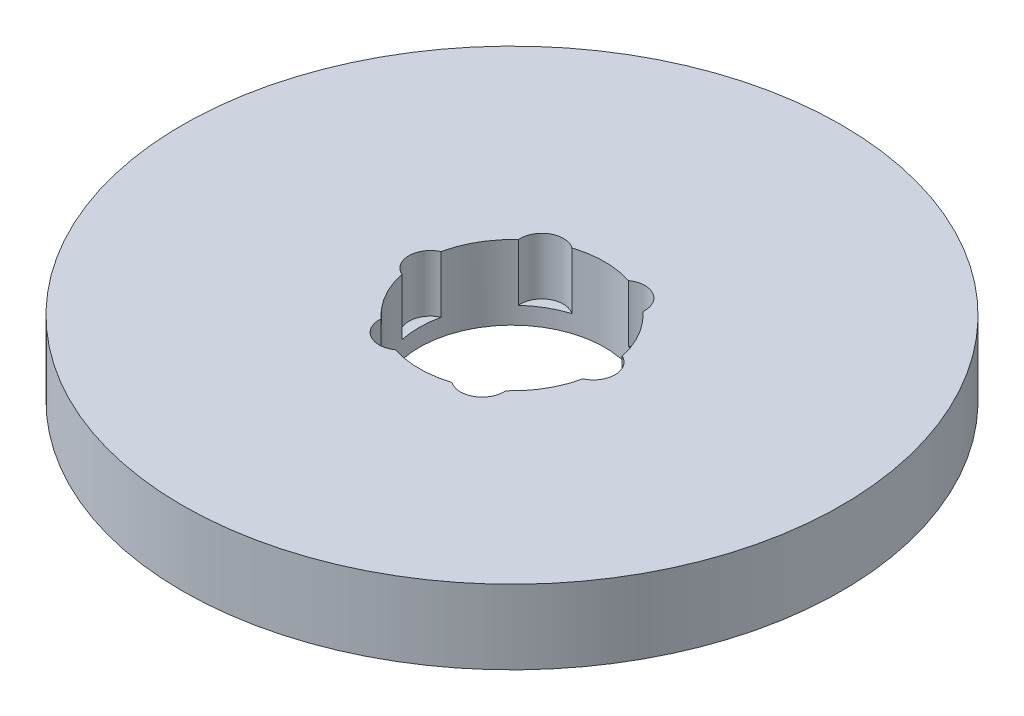
ISO-10303-21;
HEADER;
FILE_DESCRIPTION(('STEP AP214'),'2;1');
FILE_NAME('part.step','',(''),(''),'','','');
FILE_SCHEMA(('AUTOMOTIVE_DESIGN { 1 0 10303 214 1 1 1 1 }'));
ENDSEC;
DATA;
#1=APPLICATION_CONTEXT('core data for automotive mechanical design processes');
#2=APPLICATION_PROTOCOL_DEFINITION('international standard','automotive_design',2000,#1);
#3=PRODUCT_CONTEXT('',#1,'mechanical');
#4=PRODUCT('Part','Part','',(#3));
#5=PRODUCT_RELATED_PRODUCT_CATEGORY('part','',(#4));
#6=PRODUCT_DEFINITION_FORMATION('','',#4);
#7=PRODUCT_DEFINITION_CONTEXT('part definition',#1,'design');
#8=PRODUCT_DEFINITION('design','',#6,#7);
#9=PRODUCT_DEFINITION_SHAPE('','',#8);
#10=(LENGTH_UNIT() NAMED_UNIT(*) SI_UNIT(.MILLI.,.METRE.));
#11=(NAMED_UNIT(*) PLANE_ANGLE_UNIT() SI_UNIT($,.RADIAN.));
#12=(NAMED_UNIT(*) SI_UNIT($,.STERADIAN.) SOLID_ANGLE_UNIT());
#13=UNCERTAINTY_MEASURE_WITH_UNIT(LENGTH_MEASURE(1.E-05),#10,'distance_accuracy_value','');
#14=(GEOMETRIC_REPRESENTATION_CONTEXT(3) GLOBAL_UNCERTAINTY_ASSIGNED_CONTEXT((#13)) GLOBAL_UNIT_ASSIGNED_CONTEXT((#10,
#11,#12)) REPRESENTATION_CONTEXT('',''));
#15=CARTESIAN_POINT('',(0.,0.,0.));
#16=DIRECTION('',(0.,0.,1.));
#17=DIRECTION('',(1.,0.,0.));
#18=AXIS2_PLACEMENT_3D('',#15,#16,#17);
#19=CARTESIAN_POINT('',(0.,18.,0.));
#20=DIRECTION('',(0.,-1.,0.));
#21=DIRECTION('',(0.,0.,-1.));
#22=AXIS2_PLACEMENT_3D('',#19,#20,#21);
#23=CYLINDRICAL_SURFACE('',#22,80.);
#24=CARTESIAN_POINT('',(0.,18.,0.));
#25=DIRECTION('',(0.,1.,0.));
#26=DIRECTION('',(0.,0.,1.));
#27=AXIS2_PLACEMENT_3D('',#24,#25,#26);
#28=CIRCLE('',#27,80.);
#29=CARTESIAN_POINT('',(0.,18.,80.));
#30=VERTEX_POINT('',#29);
#31=EDGE_CURVE('E162',#30,#30,#28,.T.);
#32=ORIENTED_EDGE('',*,*,#31,.F.);
#33=EDGE_LOOP('',(#32));
#34=FACE_BOUND('',#33,.T.);
#35=CARTESIAN_POINT('',(0.,0.,0.));
#36=DIRECTION('',(0.,1.,0.));
#37=DIRECTION('',(0.,0.,1.));
#38=AXIS2_PLACEMENT_3D('',#35,#36,#37);
#39=CIRCLE('',#38,80.);
#40=CARTESIAN_POINT('',(0.,0.,80.));
#41=VERTEX_POINT('',#40);
#42=EDGE_CURVE('E157',#41,#41,#39,.T.);
#43=ORIENTED_EDGE('',*,*,#42,.T.);
#44=EDGE_LOOP('',(#43));
#45=FACE_BOUND('',#44,.T.);
#46=ADVANCED_FACE('F39',(#34,#45),#23,.T.);
#47=CARTESIAN_POINT('',(0.,18.,0.));
#48=DIRECTION('',(0.,1.,0.));
#49=DIRECTION('',(0.,0.,1.));
#50=AXIS2_PLACEMENT_3D('',#47,#48,#49);
#51=PLANE('',#50);
#52=CARTESIAN_POINT('',(-9.88576578177783,18.,-17.1226486057646));
#53=DIRECTION('',(0.,1.,0.));
#54=DIRECTION('',(-0.866025403784433,0.,0.50000000000001));
#55=AXIS2_PLACEMENT_3D('',#52,#53,#54);
#56=CIRCLE('',#55,5.25857324103569);
#57=CARTESIAN_POINT('',(-6.86511004216114,18.,-21.4270918257476));
#58=VERTEX_POINT('',#57);
#59=CARTESIAN_POINT('',(-15.1238508292391,18.,-16.6589056091606));
#60=VERTEX_POINT('',#59);
#61=EDGE_CURVE('E218',#58,#60,#56,.T.);
#62=ORIENTED_EDGE('',*,*,#61,.F.);
#63=CARTESIAN_POINT('',(0.,18.,0.));
#64=DIRECTION('',(0.,1.,0.));
#65=DIRECTION('',(0.,0.,1.));
#66=AXIS2_PLACEMENT_3D('',#63,#64,#65);
#67=CIRCLE('',#66,22.5);
#68=CARTESIAN_POINT('',(6.8651100421607,18.,-21.4270918257477));
#69=VERTEX_POINT('',#68);
#70=EDGE_CURVE('E169',#69,#58,#67,.T.);
#71=ORIENTED_EDGE('',*,*,#70,.F.);
#72=CARTESIAN_POINT('',(9.88576578177747,18.,-17.1226486057648));
#73=DIRECTION('',(0.,1.,0.));
#74=DIRECTION('',(-0.866025403784443,0.,-0.499999999999992));
#75=AXIS2_PLACEMENT_3D('',#72,#73,#74);
#76=CIRCLE('',#75,5.25857324103569);
#77=CARTESIAN_POINT('',(15.1238508292388,18.,-16.658905609161));
#78=VERTEX_POINT('',#77);
#79=EDGE_CURVE('E285',#78,#69,#76,.T.);
#80=ORIENTED_EDGE('',*,*,#79,.F.);
#81=CARTESIAN_POINT('',(21.9889608713998,18.,-4.76818621658683));
#82=VERTEX_POINT('',#81);
#83=EDGE_CURVE('E174',#82,#78,#67,.T.);
#84=ORIENTED_EDGE('',*,*,#83,.F.);
#85=CARTESIAN_POINT('',(19.7715315635553,18.,0.));
#86=DIRECTION('',(0.,1.,0.));
#87=DIRECTION('',(0.,0.,-1.));
#88=AXIS2_PLACEMENT_3D('',#85,#86,#87);
#89=CIRCLE('',#88,5.25857324103569);
#90=CARTESIAN_POINT('',(21.9889608713998,18.,4.76818621658683));
#91=VERTEX_POINT('',#90);
#92=EDGE_CURVE('E280',#91,#82,#89,.T.);
#93=ORIENTED_EDGE('',*,*,#92,.F.);
#94=CARTESIAN_POINT('',(15.123850829239,18.,16.6589056091607));
#95=VERTEX_POINT('',#94);
#96=EDGE_CURVE('E164',#95,#91,#67,.T.);
#97=ORIENTED_EDGE('',*,*,#96,.F.);
#98=CARTESIAN_POINT('',(9.88576578177771,18.,17.1226486057647));
#99=DIRECTION('',(0.,1.,0.));
#100=DIRECTION('',(0.866025403784436,0.,-0.500000000000004));
#101=AXIS2_PLACEMENT_3D('',#98,#99,#100);
#102=CIRCLE('',#101,5.25857324103569);
#103=CARTESIAN_POINT('',(6.86511004216099,18.,21.4270918257476));
#104=VERTEX_POINT('',#103);
#105=EDGE_CURVE('E269',#104,#95,#102,.T.);
#106=ORIENTED_EDGE('',*,*,#105,.F.);
#107=CARTESIAN_POINT('',(-6.86511004216084,18.,21.4270918257477));
#108=VERTEX_POINT('',#107);
#109=EDGE_CURVE('E149',#108,#104,#67,.T.);
#110=ORIENTED_EDGE('',*,*,#109,.F.);
#111=CARTESIAN_POINT('',(-9.88576578177759,18.,17.1226486057647));
#112=DIRECTION('',(0.,1.,0.));
#113=DIRECTION('',(0.86602540378444,0.,0.499999999999998));
#114=AXIS2_PLACEMENT_3D('',#111,#112,#113);
#115=CIRCLE('',#114,5.25857324103569);
#116=CARTESIAN_POINT('',(-15.1238508292389,18.,16.6589056091609));
#117=VERTEX_POINT('',#116);
#118=EDGE_CURVE('E128',#117,#108,#115,.T.);
#119=ORIENTED_EDGE('',*,*,#118,.F.);
#120=CARTESIAN_POINT('',(-21.9889608713998,18.,4.76818621658683));
#121=VERTEX_POINT('',#120);
#122=EDGE_CURVE('E148',#121,#117,#67,.T.);
#123=ORIENTED_EDGE('',*,*,#122,.F.);
#124=CARTESIAN_POINT('',(-19.7715315635553,18.,0.));
#125=DIRECTION('',(0.,1.,0.));
#126=DIRECTION('',(0.,0.,1.));
#127=AXIS2_PLACEMENT_3D('',#124,#125,#126);
#128=CIRCLE('',#127,5.25857324103569);
#129=CARTESIAN_POINT('',(-21.9889608713998,18.,-4.76818621658683));
#130=VERTEX_POINT('',#129);
#131=EDGE_CURVE('E179',#130,#121,#128,.T.);
#132=ORIENTED_EDGE('',*,*,#131,.F.);
#133=EDGE_CURVE('E161',#60,#130,#67,.T.);
#134=ORIENTED_EDGE('',*,*,#133,.F.);
#135=EDGE_LOOP('',(#62,#71,#80,#84,#93,#97,#106,#110,#119,#123,#132,#134));
#136=FACE_BOUND('',#135,.T.);
#137=ORIENTED_EDGE('',*,*,#31,.T.);
#138=EDGE_LOOP('',(#137));
#139=FACE_BOUND('',#138,.T.);
#140=ADVANCED_FACE('F141',(#136,#139),#51,.T.);
#141=CARTESIAN_POINT('',(0.,0.,0.));
#142=DIRECTION('',(0.,1.,0.));
#143=DIRECTION('',(0.,0.,1.));
#144=AXIS2_PLACEMENT_3D('',#141,#142,#143);
#145=PLANE('',#144);
#146=CARTESIAN_POINT('',(0.,0.,0.));
#147=DIRECTION('',(0.,1.,0.));
#148=DIRECTION('',(0.,0.,1.));
#149=AXIS2_PLACEMENT_3D('',#146,#147,#148);
#150=CIRCLE('',#149,22.5);
#151=CARTESIAN_POINT('',(0.,0.,22.5));
#152=VERTEX_POINT('',#151);
#153=EDGE_CURVE('E166',#152,#152,#150,.T.);
#154=ORIENTED_EDGE('',*,*,#153,.T.);
#155=EDGE_LOOP('',(#154));
#156=FACE_BOUND('',#155,.T.);
#157=ORIENTED_EDGE('',*,*,#42,.F.);
#158=EDGE_LOOP('',(#157));
#159=FACE_BOUND('',#158,.T.);
#160=ADVANCED_FACE('F234',(#156,#159),#145,.F.);
#161=CARTESIAN_POINT('',(0.,18.,0.));
#162=DIRECTION('',(0.,-1.,0.));
#163=DIRECTION('',(0.,0.,-1.));
#164=AXIS2_PLACEMENT_3D('',#161,#162,#163);
#165=CYLINDRICAL_SURFACE('',#164,22.5);
#166=DIRECTION('',(0.,1.,0.));
#167=VECTOR('',#166,1.);
#168=CARTESIAN_POINT('',(-6.86511004216115,11.0970569981778,-21.4270918257476));
#169=LINE('',#168,#167);
#170=CARTESIAN_POINT('',(-6.86511004216114,4.1941139963557,-21.4270918257476));
#171=VERTEX_POINT('',#170);
#172=EDGE_CURVE('E11',#171,#58,#169,.T.);
#173=ORIENTED_EDGE('',*,*,#172,.F.);
#174=CARTESIAN_POINT('',(0.,4.1941139963557,0.));
#175=DIRECTION('',(0.,1.,0.));
#176=DIRECTION('',(0.,0.,1.));
#177=AXIS2_PLACEMENT_3D('',#174,#175,#176);
#178=CIRCLE('',#177,22.5);
#179=CARTESIAN_POINT('',(-15.1238508292391,4.1941139963557,-16.6589056091606));
#180=VERTEX_POINT('',#179);
#181=EDGE_CURVE('E214',#171,#180,#178,.T.);
#182=ORIENTED_EDGE('',*,*,#181,.T.);
#183=DIRECTION('',(0.,1.,0.));
#184=VECTOR('',#183,1.);
#185=CARTESIAN_POINT('',(-15.1238508292391,11.0970569981778,-16.6589056091606));
#186=LINE('',#185,#184);
#187=EDGE_CURVE('E46',#60,#180,#186,.F.);
#188=ORIENTED_EDGE('',*,*,#187,.F.);
#189=ORIENTED_EDGE('',*,*,#133,.T.);
#190=DIRECTION('',(0.,1.,0.));
#191=VECTOR('',#190,1.);
#192=CARTESIAN_POINT('',(-21.9889608713998,11.0970569981778,-4.76818621658683));
#193=LINE('',#192,#191);
#194=CARTESIAN_POINT('',(-21.9889608713998,4.1941139963557,-4.76818621658683));
#195=VERTEX_POINT('',#194);
#196=EDGE_CURVE('E187',#195,#130,#193,.T.);
#197=ORIENTED_EDGE('',*,*,#196,.F.);
#198=CARTESIAN_POINT('',(0.,4.1941139963557,0.));
#199=DIRECTION('',(0.,1.,0.));
#200=DIRECTION('',(0.,0.,1.));
#201=AXIS2_PLACEMENT_3D('',#198,#199,#200);
#202=CIRCLE('',#201,22.5);
#203=CARTESIAN_POINT('',(-21.9889608713998,4.1941139963557,4.76818621658683));
#204=VERTEX_POINT('',#203);
#205=EDGE_CURVE('E184',#195,#204,#202,.T.);
#206=ORIENTED_EDGE('',*,*,#205,.T.);
#207=DIRECTION('',(0.,1.,0.));
#208=VECTOR('',#207,1.);
#209=CARTESIAN_POINT('',(-21.9889608713998,11.0970569981778,4.76818621658683));
#210=LINE('',#209,#208);
#211=EDGE_CURVE('E158',#121,#204,#210,.F.);
#212=ORIENTED_EDGE('',*,*,#211,.F.);
#213=ORIENTED_EDGE('',*,*,#122,.T.);
#214=DIRECTION('',(0.,1.,0.));
#215=VECTOR('',#214,1.);
#216=CARTESIAN_POINT('',(-15.1238508292389,11.0970569981778,16.6589056091609));
#217=LINE('',#216,#215);
#218=CARTESIAN_POINT('',(-15.1238508292389,4.1941139963557,16.6589056091609));
#219=VERTEX_POINT('',#218);
#220=EDGE_CURVE('E127',#219,#117,#217,.T.);
#221=ORIENTED_EDGE('',*,*,#220,.F.);
#222=CARTESIAN_POINT('',(0.,4.1941139963557,0.));
#223=DIRECTION('',(0.,1.,0.));
#224=DIRECTION('',(0.,0.,1.));
#225=AXIS2_PLACEMENT_3D('',#222,#223,#224);
#226=CIRCLE('',#225,22.5);
#227=CARTESIAN_POINT('',(-6.86511004216084,4.1941139963557,21.4270918257477));
#228=VERTEX_POINT('',#227);
#229=EDGE_CURVE('E189',#219,#228,#226,.T.);
#230=ORIENTED_EDGE('',*,*,#229,.T.);
#231=DIRECTION('',(0.,1.,0.));
#232=VECTOR('',#231,1.);
#233=CARTESIAN_POINT('',(-6.86511004216085,11.0970569981778,21.4270918257477));
#234=LINE('',#233,#232);
#235=EDGE_CURVE('E140',#108,#228,#234,.F.);
#236=ORIENTED_EDGE('',*,*,#235,.F.);
#237=ORIENTED_EDGE('',*,*,#109,.T.);
#238=DIRECTION('',(0.,1.,0.));
#239=VECTOR('',#238,1.);
#240=CARTESIAN_POINT('',(6.86511004216099,11.0970569981778,21.4270918257476));
#241=LINE('',#240,#239);
#242=CARTESIAN_POINT('',(6.86511004216099,4.1941139963557,21.4270918257476));
#243=VERTEX_POINT('',#242);
#244=EDGE_CURVE('E196',#243,#104,#241,.T.);
#245=ORIENTED_EDGE('',*,*,#244,.F.);
#246=CARTESIAN_POINT('',(0.,4.1941139963557,0.));
#247=DIRECTION('',(0.,1.,0.));
#248=DIRECTION('',(0.,0.,1.));
#249=AXIS2_PLACEMENT_3D('',#246,#247,#248);
#250=CIRCLE('',#249,22.5);
#251=CARTESIAN_POINT('',(15.123850829239,4.1941139963557,16.6589056091607));
#252=VERTEX_POINT('',#251);
#253=EDGE_CURVE('E136',#243,#252,#250,.T.);
#254=ORIENTED_EDGE('',*,*,#253,.T.);
#255=DIRECTION('',(0.,1.,0.));
#256=VECTOR('',#255,1.);
#257=CARTESIAN_POINT('',(15.123850829239,11.0970569981778,16.6589056091608));
#258=LINE('',#257,#256);
#259=EDGE_CURVE('E194',#95,#252,#258,.F.);
#260=ORIENTED_EDGE('',*,*,#259,.F.);
#261=ORIENTED_EDGE('',*,*,#96,.T.);
#262=DIRECTION('',(0.,1.,0.));
#263=VECTOR('',#262,1.);
#264=CARTESIAN_POINT('',(21.9889608713998,11.0970569981778,4.76818621658683));
#265=LINE('',#264,#263);
#266=CARTESIAN_POINT('',(21.9889608713998,4.1941139963557,4.76818621658683));
#267=VERTEX_POINT('',#266);
#268=EDGE_CURVE('E206',#267,#91,#265,.T.);
#269=ORIENTED_EDGE('',*,*,#268,.F.);
#270=CARTESIAN_POINT('',(0.,4.1941139963557,0.));
#271=DIRECTION('',(0.,1.,0.));
#272=DIRECTION('',(0.,0.,1.));
#273=AXIS2_PLACEMENT_3D('',#270,#271,#272);
#274=CIRCLE('',#273,22.5);
#275=CARTESIAN_POINT('',(21.9889608713998,4.1941139963557,-4.76818621658683));
#276=VERTEX_POINT('',#275);
#277=EDGE_CURVE('E199',#267,#276,#274,.T.);
#278=ORIENTED_EDGE('',*,*,#277,.T.);
#279=DIRECTION('',(0.,1.,0.));
#280=VECTOR('',#279,1.);
#281=CARTESIAN_POINT('',(21.9889608713998,11.0970569981778,-4.76818621658683));
#282=LINE('',#281,#280);
#283=EDGE_CURVE('E201',#82,#276,#282,.F.);
#284=ORIENTED_EDGE('',*,*,#283,.F.);
#285=ORIENTED_EDGE('',*,*,#83,.T.);
#286=DIRECTION('',(0.,1.,0.));
#287=VECTOR('',#286,1.);
#288=CARTESIAN_POINT('',(15.1238508292388,11.0970569981778,-16.658905609161));
#289=LINE('',#288,#287);
#290=CARTESIAN_POINT('',(15.1238508292388,4.1941139963557,-16.658905609161));
#291=VERTEX_POINT('',#290);
#292=EDGE_CURVE('E213',#291,#78,#289,.T.);
#293=ORIENTED_EDGE('',*,*,#292,.F.);
#294=CARTESIAN_POINT('',(0.,4.1941139963557,0.));
#295=DIRECTION('',(0.,1.,0.));
#296=DIRECTION('',(0.,0.,1.));
#297=AXIS2_PLACEMENT_3D('',#294,#295,#296);
#298=CIRCLE('',#297,22.5);
#299=CARTESIAN_POINT('',(6.8651100421607,4.1941139963557,-21.4270918257477));
#300=VERTEX_POINT('',#299);
#301=EDGE_CURVE('E208',#291,#300,#298,.T.);
#302=ORIENTED_EDGE('',*,*,#301,.T.);
#303=DIRECTION('',(0.,1.,0.));
#304=VECTOR('',#303,1.);
#305=CARTESIAN_POINT('',(6.8651100421607,11.0970569981778,-21.4270918257477));
#306=LINE('',#305,#304);
#307=EDGE_CURVE('E211',#69,#300,#306,.F.);
#308=ORIENTED_EDGE('',*,*,#307,.F.);
#309=ORIENTED_EDGE('',*,*,#70,.T.);
#310=EDGE_LOOP('',(#173,#182,#188,#189,#197,#206,#212,#213,#221,#230,#236,#237,#245,#254,#260,
#261,#269,#278,#284,#285,#293,#302,#308,#309));
#311=FACE_BOUND('',#310,.T.);
#312=ORIENTED_EDGE('',*,*,#153,.F.);
#313=EDGE_LOOP('',(#312));
#314=FACE_BOUND('',#313,.T.);
#315=ADVANCED_FACE('F152',(#311,#314),#165,.F.);
#316=CARTESIAN_POINT('',(-19.7715315635553,4.1941139963557,0.));
#317=DIRECTION('',(0.,1.,0.));
#318=DIRECTION('',(0.,0.,1.));
#319=AXIS2_PLACEMENT_3D('',#316,#317,#318);
#320=CYLINDRICAL_SURFACE('',#319,5.25857324103569);
#321=ORIENTED_EDGE('',*,*,#196,.T.);
#322=ORIENTED_EDGE('',*,*,#131,.T.);
#323=ORIENTED_EDGE('',*,*,#211,.T.);
#324=CARTESIAN_POINT('',(-19.7715315635553,4.1941139963557,0.));
#325=DIRECTION('',(0.,1.,0.));
#326=DIRECTION('',(0.,0.,1.));
#327=AXIS2_PLACEMENT_3D('',#324,#325,#326);
#328=CIRCLE('',#327,5.25857324103569);
#329=EDGE_CURVE('E180',#195,#204,#328,.T.);
#330=ORIENTED_EDGE('',*,*,#329,.F.);
#331=EDGE_LOOP('',(#321,#322,#323,#330));
#332=FACE_BOUND('',#331,.T.);
#333=ADVANCED_FACE('F244',(#332),#320,.F.);
#334=CARTESIAN_POINT('',(-19.7715315635553,4.1941139963557,0.));
#335=DIRECTION('',(0.,1.,0.));
#336=DIRECTION('',(0.,0.,1.));
#337=AXIS2_PLACEMENT_3D('',#334,#335,#336);
#338=PLANE('',#337);
#339=ORIENTED_EDGE('',*,*,#329,.T.);
#340=ORIENTED_EDGE('',*,*,#205,.F.);
#341=EDGE_LOOP('',(#339,#340));
#342=FACE_BOUND('',#341,.T.);
#343=ADVANCED_FACE('F248',(#342),#338,.T.);
#344=CARTESIAN_POINT('',(-9.88576578177759,4.1941139963557,17.1226486057647));
#345=DIRECTION('',(0.,1.,0.));
#346=DIRECTION('',(0.,0.,1.));
#347=AXIS2_PLACEMENT_3D('',#344,#345,#346);
#348=CYLINDRICAL_SURFACE('',#347,5.25857324103569);
#349=ORIENTED_EDGE('',*,*,#220,.T.);
#350=ORIENTED_EDGE('',*,*,#118,.T.);
#351=ORIENTED_EDGE('',*,*,#235,.T.);
#352=CARTESIAN_POINT('',(-9.88576578177759,4.1941139963557,17.1226486057647));
#353=DIRECTION('',(0.,1.,0.));
#354=DIRECTION('',(0.86602540378444,0.,0.499999999999998));
#355=AXIS2_PLACEMENT_3D('',#352,#353,#354);
#356=CIRCLE('',#355,5.25857324103569);
#357=EDGE_CURVE('E135',#219,#228,#356,.T.);
#358=ORIENTED_EDGE('',*,*,#357,.F.);
#359=EDGE_LOOP('',(#349,#350,#351,#358));
#360=FACE_BOUND('',#359,.T.);
#361=ADVANCED_FACE('F126',(#360),#348,.F.);
#362=CARTESIAN_POINT('',(-9.88576578177759,4.1941139963557,17.1226486057647));
#363=DIRECTION('',(0.,1.,0.));
#364=DIRECTION('',(0.86602540378444,0.,0.499999999999998));
#365=AXIS2_PLACEMENT_3D('',#362,#363,#364);
#366=PLANE('',#365);
#367=ORIENTED_EDGE('',*,*,#357,.T.);
#368=ORIENTED_EDGE('',*,*,#229,.F.);
#369=EDGE_LOOP('',(#367,#368));
#370=FACE_BOUND('',#369,.T.);
#371=ADVANCED_FACE('F258',(#370),#366,.T.);
#372=CARTESIAN_POINT('',(9.88576578177771,4.1941139963557,17.1226486057647));
#373=DIRECTION('',(0.,1.,0.));
#374=DIRECTION('',(0.,0.,1.));
#375=AXIS2_PLACEMENT_3D('',#372,#373,#374);
#376=CYLINDRICAL_SURFACE('',#375,5.25857324103569);
#377=ORIENTED_EDGE('',*,*,#244,.T.);
#378=ORIENTED_EDGE('',*,*,#105,.T.);
#379=ORIENTED_EDGE('',*,*,#259,.T.);
#380=CARTESIAN_POINT('',(9.88576578177771,4.1941139963557,17.1226486057647));
#381=DIRECTION('',(0.,1.,0.));
#382=DIRECTION('',(0.866025403784436,0.,-0.500000000000004));
#383=AXIS2_PLACEMENT_3D('',#380,#381,#382);
#384=CIRCLE('',#383,5.25857324103569);
#385=EDGE_CURVE('E147',#243,#252,#384,.T.);
#386=ORIENTED_EDGE('',*,*,#385,.F.);
#387=EDGE_LOOP('',(#377,#378,#379,#386));
#388=FACE_BOUND('',#387,.T.);
#389=ADVANCED_FACE('F256',(#388),#376,.F.);
#390=CARTESIAN_POINT('',(9.88576578177771,4.1941139963557,17.1226486057647));
#391=DIRECTION('',(0.,1.,0.));
#392=DIRECTION('',(0.866025403784436,0.,-0.500000000000004));
#393=AXIS2_PLACEMENT_3D('',#390,#391,#392);
#394=PLANE('',#393);
#395=ORIENTED_EDGE('',*,*,#385,.T.);
#396=ORIENTED_EDGE('',*,*,#253,.F.);
#397=EDGE_LOOP('',(#395,#396));
#398=FACE_BOUND('',#397,.T.);
#399=ADVANCED_FACE('F263',(#398),#394,.T.);
#400=CARTESIAN_POINT('',(19.7715315635553,4.1941139963557,0.));
#401=DIRECTION('',(0.,1.,0.));
#402=DIRECTION('',(0.,0.,1.));
#403=AXIS2_PLACEMENT_3D('',#400,#401,#402);
#404=CYLINDRICAL_SURFACE('',#403,5.25857324103569);
#405=ORIENTED_EDGE('',*,*,#268,.T.);
#406=ORIENTED_EDGE('',*,*,#92,.T.);
#407=ORIENTED_EDGE('',*,*,#283,.T.);
#408=CARTESIAN_POINT('',(19.7715315635553,4.1941139963557,0.));
#409=DIRECTION('',(0.,1.,0.));
#410=DIRECTION('',(0.,0.,-1.));
#411=AXIS2_PLACEMENT_3D('',#408,#409,#410);
#412=CIRCLE('',#411,5.25857324103569);
#413=EDGE_CURVE('E273',#267,#276,#412,.T.);
#414=ORIENTED_EDGE('',*,*,#413,.F.);
#415=EDGE_LOOP('',(#405,#406,#407,#414));
#416=FACE_BOUND('',#415,.T.);
#417=ADVANCED_FACE('F297',(#416),#404,.F.);
#418=CARTESIAN_POINT('',(19.7715315635553,4.1941139963557,0.));
#419=DIRECTION('',(0.,1.,0.));
#420=DIRECTION('',(0.,0.,-1.));
#421=AXIS2_PLACEMENT_3D('',#418,#419,#420);
#422=PLANE('',#421);
#423=ORIENTED_EDGE('',*,*,#413,.T.);
#424=ORIENTED_EDGE('',*,*,#277,.F.);
#425=EDGE_LOOP('',(#423,#424));
#426=FACE_BOUND('',#425,.T.);
#427=ADVANCED_FACE('F299',(#426),#422,.T.);
#428=CARTESIAN_POINT('',(9.88576578177747,4.1941139963557,-17.1226486057648));
#429=DIRECTION('',(0.,1.,0.));
#430=DIRECTION('',(0.,0.,1.));
#431=AXIS2_PLACEMENT_3D('',#428,#429,#430);
#432=CYLINDRICAL_SURFACE('',#431,5.25857324103569);
#433=ORIENTED_EDGE('',*,*,#292,.T.);
#434=ORIENTED_EDGE('',*,*,#79,.T.);
#435=ORIENTED_EDGE('',*,*,#307,.T.);
#436=CARTESIAN_POINT('',(9.88576578177747,4.1941139963557,-17.1226486057648));
#437=DIRECTION('',(0.,1.,0.));
#438=DIRECTION('',(-0.866025403784443,0.,-0.499999999999992));
#439=AXIS2_PLACEMENT_3D('',#436,#437,#438);
#440=CIRCLE('',#439,5.25857324103569);
#441=EDGE_CURVE('E56',#291,#300,#440,.T.);
#442=ORIENTED_EDGE('',*,*,#441,.F.);
#443=EDGE_LOOP('',(#433,#434,#435,#442));
#444=FACE_BOUND('',#443,.T.);
#445=ADVANCED_FACE('F292',(#444),#432,.F.);
#446=CARTESIAN_POINT('',(9.88576578177747,4.1941139963557,-17.1226486057648));
#447=DIRECTION('',(0.,1.,0.));
#448=DIRECTION('',(-0.866025403784443,0.,-0.499999999999992));
#449=AXIS2_PLACEMENT_3D('',#446,#447,#448);
#450=PLANE('',#449);
#451=ORIENTED_EDGE('',*,*,#441,.T.);
#452=ORIENTED_EDGE('',*,*,#301,.F.);
#453=EDGE_LOOP('',(#451,#452));
#454=FACE_BOUND('',#453,.T.);
#455=ADVANCED_FACE('F226',(#454),#450,.T.);
#456=CARTESIAN_POINT('',(-9.88576578177783,4.1941139963557,-17.1226486057646));
#457=DIRECTION('',(0.,1.,0.));
#458=DIRECTION('',(0.,0.,1.));
#459=AXIS2_PLACEMENT_3D('',#456,#457,#458);
#460=CYLINDRICAL_SURFACE('',#459,5.25857324103569);
#461=ORIENTED_EDGE('',*,*,#172,.T.);
#462=ORIENTED_EDGE('',*,*,#61,.T.);
#463=ORIENTED_EDGE('',*,*,#187,.T.);
#464=CARTESIAN_POINT('',(-9.88576578177783,4.1941139963557,-17.1226486057646));
#465=DIRECTION('',(0.,1.,0.));
#466=DIRECTION('',(-0.866025403784433,0.,0.50000000000001));
#467=AXIS2_PLACEMENT_3D('',#464,#465,#466);
#468=CIRCLE('',#467,5.25857324103569);
#469=EDGE_CURVE('E55',#171,#180,#468,.T.);
#470=ORIENTED_EDGE('',*,*,#469,.F.);
#471=EDGE_LOOP('',(#461,#462,#463,#470));
#472=FACE_BOUND('',#471,.T.);
#473=ADVANCED_FACE('F217',(#472),#460,.F.);
#474=CARTESIAN_POINT('',(-9.88576578177783,4.1941139963557,-17.1226486057646));
#475=DIRECTION('',(0.,1.,0.));
#476=DIRECTION('',(-0.866025403784433,0.,0.50000000000001));
#477=AXIS2_PLACEMENT_3D('',#474,#475,#476);
#478=PLANE('',#477);
#479=ORIENTED_EDGE('',*,*,#469,.T.);
#480=ORIENTED_EDGE('',*,*,#181,.F.);
#481=EDGE_LOOP('',(#479,#480));
#482=FACE_BOUND('',#481,.T.);
#483=ADVANCED_FACE('F219',(#482),#478,.T.);
#484=CLOSED_SHELL('',(#46,#140,#160,#315,#333,#343,#361,#371,#389,#399,#417,#427,#445,#455,#473,#483));
#485=MANIFOLD_SOLID_BREP('B2',#484);
#486=ADVANCED_BREP_SHAPE_REPRESENTATION('',(#18,#485),#14);
#487=SHAPE_DEFINITION_REPRESENTATION(#9,#486);
ENDSEC;
END-ISO-10303-21;
